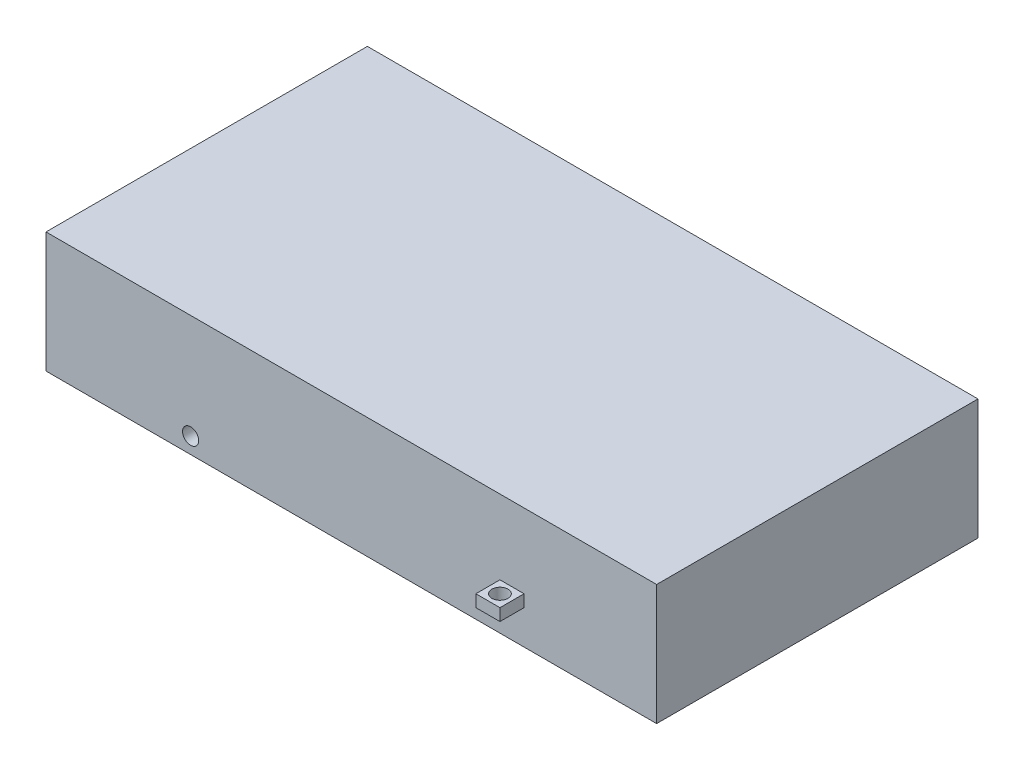
ISO-10303-21;
HEADER;
FILE_DESCRIPTION(('STEP AP214'),'2;1');
FILE_NAME('part.step','',(''),(''),'','','');
FILE_SCHEMA(('AUTOMOTIVE_DESIGN { 1 0 10303 214 1 1 1 1 }'));
ENDSEC;
DATA;
#1=APPLICATION_CONTEXT('core data for automotive mechanical design processes');
#2=APPLICATION_PROTOCOL_DEFINITION('international standard','automotive_design',2000,#1);
#3=PRODUCT_CONTEXT('',#1,'mechanical');
#4=PRODUCT('Part','Part','',(#3));
#5=PRODUCT_RELATED_PRODUCT_CATEGORY('part','',(#4));
#6=PRODUCT_DEFINITION_FORMATION('','',#4);
#7=PRODUCT_DEFINITION_CONTEXT('part definition',#1,'design');
#8=PRODUCT_DEFINITION('design','',#6,#7);
#9=PRODUCT_DEFINITION_SHAPE('','',#8);
#10=(LENGTH_UNIT() NAMED_UNIT(*) SI_UNIT(.MILLI.,.METRE.));
#11=(NAMED_UNIT(*) PLANE_ANGLE_UNIT() SI_UNIT($,.RADIAN.));
#12=(NAMED_UNIT(*) SI_UNIT($,.STERADIAN.) SOLID_ANGLE_UNIT());
#13=UNCERTAINTY_MEASURE_WITH_UNIT(LENGTH_MEASURE(1.E-05),#10,'distance_accuracy_value','');
#14=(GEOMETRIC_REPRESENTATION_CONTEXT(3) GLOBAL_UNCERTAINTY_ASSIGNED_CONTEXT((#13)) GLOBAL_UNIT_ASSIGNED_CONTEXT((#10,
#11,#12)) REPRESENTATION_CONTEXT('',''));
#15=CARTESIAN_POINT('',(0.,0.,0.));
#16=DIRECTION('',(0.,0.,1.));
#17=DIRECTION('',(1.,0.,0.));
#18=AXIS2_PLACEMENT_3D('',#15,#16,#17);
#19=CARTESIAN_POINT('',(-482.6,190.5,-254.));
#20=DIRECTION('',(0.,0.,1.));
#21=DIRECTION('',(1.,0.,0.));
#22=AXIS2_PLACEMENT_3D('',#19,#20,#21);
#23=PLANE('',#22);
#24=DIRECTION('',(-1.,0.,0.));
#25=VECTOR('',#24,1.);
#26=CARTESIAN_POINT('',(-482.6,0.,-254.));
#27=LINE('',#26,#25);
#28=CARTESIAN_POINT('',(482.6,0.,-254.));
#29=VERTEX_POINT('',#28);
#30=CARTESIAN_POINT('',(-482.6,0.,-254.));
#31=VERTEX_POINT('',#30);
#32=EDGE_CURVE('E222',#29,#31,#27,.T.);
#33=ORIENTED_EDGE('',*,*,#32,.T.);
#34=DIRECTION('',(0.,-1.,0.));
#35=VECTOR('',#34,1.);
#36=CARTESIAN_POINT('',(-482.6,190.5,-254.));
#37=LINE('',#36,#35);
#38=CARTESIAN_POINT('',(-482.6,190.5,-254.));
#39=VERTEX_POINT('',#38);
#40=EDGE_CURVE('E45',#39,#31,#37,.T.);
#41=ORIENTED_EDGE('',*,*,#40,.F.);
#42=DIRECTION('',(-1.,0.,0.));
#43=VECTOR('',#42,1.);
#44=CARTESIAN_POINT('',(-482.6,190.5,-254.));
#45=LINE('',#44,#43);
#46=CARTESIAN_POINT('',(482.6,190.5,-254.));
#47=VERTEX_POINT('',#46);
#48=EDGE_CURVE('E212',#47,#39,#45,.T.);
#49=ORIENTED_EDGE('',*,*,#48,.F.);
#50=DIRECTION('',(0.,-1.,0.));
#51=VECTOR('',#50,1.);
#52=CARTESIAN_POINT('',(482.6,190.5,-254.));
#53=LINE('',#52,#51);
#54=EDGE_CURVE('E11',#47,#29,#53,.T.);
#55=ORIENTED_EDGE('',*,*,#54,.T.);
#56=EDGE_LOOP('',(#33,#41,#49,#55));
#57=FACE_BOUND('',#56,.T.);
#58=CARTESIAN_POINT('',(-254.,25.4,-254.));
#59=DIRECTION('',(0.,0.,1.));
#60=DIRECTION('',(1.,0.,0.));
#61=AXIS2_PLACEMENT_3D('',#58,#59,#60);
#62=CIRCLE('',#61,12.7);
#63=CARTESIAN_POINT('',(-241.3,25.4,-254.));
#64=VERTEX_POINT('',#63);
#65=EDGE_CURVE('E172',#64,#64,#62,.F.);
#66=ORIENTED_EDGE('',*,*,#65,.F.);
#67=EDGE_LOOP('',(#66));
#68=FACE_BOUND('',#67,.T.);
#69=DIRECTION('',(0.,1.,0.));
#70=VECTOR('',#69,1.);
#71=CARTESIAN_POINT('',(234.95,53.975,-254.));
#72=LINE('',#71,#70);
#73=CARTESIAN_POINT('',(234.95,53.975,-254.));
#74=VERTEX_POINT('',#73);
#75=CARTESIAN_POINT('',(234.95,73.025,-254.));
#76=VERTEX_POINT('',#75);
#77=EDGE_CURVE('E158',#74,#76,#72,.T.);
#78=ORIENTED_EDGE('',*,*,#77,.F.);
#79=DIRECTION('',(1.,0.,0.));
#80=VECTOR('',#79,1.);
#81=CARTESIAN_POINT('',(234.95,53.975,-254.));
#82=LINE('',#81,#80);
#83=CARTESIAN_POINT('',(273.05,53.975,-254.));
#84=VERTEX_POINT('',#83);
#85=EDGE_CURVE('E134',#74,#84,#82,.T.);
#86=ORIENTED_EDGE('',*,*,#85,.T.);
#87=DIRECTION('',(0.,1.,0.));
#88=VECTOR('',#87,1.);
#89=CARTESIAN_POINT('',(273.05,53.975,-254.));
#90=LINE('',#89,#88);
#91=CARTESIAN_POINT('',(273.05,73.025,-254.));
#92=VERTEX_POINT('',#91);
#93=EDGE_CURVE('E52',#84,#92,#90,.T.);
#94=ORIENTED_EDGE('',*,*,#93,.T.);
#95=DIRECTION('',(1.,0.,0.));
#96=VECTOR('',#95,1.);
#97=CARTESIAN_POINT('',(234.95,73.025,-254.));
#98=LINE('',#97,#96);
#99=EDGE_CURVE('E147',#76,#92,#98,.T.);
#100=ORIENTED_EDGE('',*,*,#99,.F.);
#101=EDGE_LOOP('',(#78,#86,#94,#100));
#102=FACE_BOUND('',#101,.T.);
#103=ADVANCED_FACE('F37',(#57,#68,#102),#23,.F.);
#104=CARTESIAN_POINT('',(482.6,190.5,254.));
#105=DIRECTION('',(-1.,0.,0.));
#106=DIRECTION('',(0.,0.,1.));
#107=AXIS2_PLACEMENT_3D('',#104,#105,#106);
#108=PLANE('',#107);
#109=DIRECTION('',(0.,0.,-1.));
#110=VECTOR('',#109,1.);
#111=CARTESIAN_POINT('',(482.6,0.,254.));
#112=LINE('',#111,#110);
#113=CARTESIAN_POINT('',(482.6,0.,254.));
#114=VERTEX_POINT('',#113);
#115=EDGE_CURVE('E203',#114,#29,#112,.T.);
#116=ORIENTED_EDGE('',*,*,#115,.T.);
#117=ORIENTED_EDGE('',*,*,#54,.F.);
#118=DIRECTION('',(0.,0.,-1.));
#119=VECTOR('',#118,1.);
#120=CARTESIAN_POINT('',(482.6,190.5,254.));
#121=LINE('',#120,#119);
#122=CARTESIAN_POINT('',(482.6,190.5,254.));
#123=VERTEX_POINT('',#122);
#124=EDGE_CURVE('E209',#123,#47,#121,.T.);
#125=ORIENTED_EDGE('',*,*,#124,.F.);
#126=DIRECTION('',(0.,-1.,0.));
#127=VECTOR('',#126,1.);
#128=CARTESIAN_POINT('',(482.6,190.5,254.));
#129=LINE('',#128,#127);
#130=EDGE_CURVE('E219',#123,#114,#129,.T.);
#131=ORIENTED_EDGE('',*,*,#130,.T.);
#132=EDGE_LOOP('',(#116,#117,#125,#131));
#133=FACE_BOUND('',#132,.T.);
#134=ADVANCED_FACE('F39',(#133),#108,.F.);
#135=CARTESIAN_POINT('',(-482.6,190.5,254.));
#136=DIRECTION('',(1.,0.,0.));
#137=DIRECTION('',(0.,0.,-1.));
#138=AXIS2_PLACEMENT_3D('',#135,#136,#137);
#139=PLANE('',#138);
#140=DIRECTION('',(0.,0.,1.));
#141=VECTOR('',#140,1.);
#142=CARTESIAN_POINT('',(-482.6,0.,254.));
#143=LINE('',#142,#141);
#144=CARTESIAN_POINT('',(-482.6,0.,254.));
#145=VERTEX_POINT('',#144);
#146=EDGE_CURVE('E224',#31,#145,#143,.T.);
#147=ORIENTED_EDGE('',*,*,#146,.T.);
#148=DIRECTION('',(0.,-1.,0.));
#149=VECTOR('',#148,1.);
#150=CARTESIAN_POINT('',(-482.6,190.5,254.));
#151=LINE('',#150,#149);
#152=CARTESIAN_POINT('',(-482.6,190.5,254.));
#153=VERTEX_POINT('',#152);
#154=EDGE_CURVE('E229',#153,#145,#151,.T.);
#155=ORIENTED_EDGE('',*,*,#154,.F.);
#156=DIRECTION('',(0.,0.,1.));
#157=VECTOR('',#156,1.);
#158=CARTESIAN_POINT('',(-482.6,190.5,254.));
#159=LINE('',#158,#157);
#160=EDGE_CURVE('E215',#39,#153,#159,.T.);
#161=ORIENTED_EDGE('',*,*,#160,.F.);
#162=ORIENTED_EDGE('',*,*,#40,.T.);
#163=EDGE_LOOP('',(#147,#155,#161,#162));
#164=FACE_BOUND('',#163,.T.);
#165=ADVANCED_FACE('F236',(#164),#139,.F.);
#166=CARTESIAN_POINT('',(-482.6,190.5,254.));
#167=DIRECTION('',(0.,0.,-1.));
#168=DIRECTION('',(-1.,0.,0.));
#169=AXIS2_PLACEMENT_3D('',#166,#167,#168);
#170=PLANE('',#169);
#171=CARTESIAN_POINT('',(-254.,25.4,254.));
#172=DIRECTION('',(0.,0.,1.));
#173=DIRECTION('',(1.,0.,0.));
#174=AXIS2_PLACEMENT_3D('',#171,#172,#173);
#175=CIRCLE('',#174,12.7);
#176=CARTESIAN_POINT('',(-241.3,25.4,254.));
#177=VERTEX_POINT('',#176);
#178=EDGE_CURVE('E166',#177,#177,#175,.T.);
#179=ORIENTED_EDGE('',*,*,#178,.F.);
#180=EDGE_LOOP('',(#179));
#181=FACE_BOUND('',#180,.T.);
#182=DIRECTION('',(1.,0.,0.));
#183=VECTOR('',#182,1.);
#184=CARTESIAN_POINT('',(234.95,53.975,254.));
#185=LINE('',#184,#183);
#186=CARTESIAN_POINT('',(234.95,53.975,254.));
#187=VERTEX_POINT('',#186);
#188=CARTESIAN_POINT('',(273.05,53.975,254.));
#189=VERTEX_POINT('',#188);
#190=EDGE_CURVE('E186',#187,#189,#185,.T.);
#191=ORIENTED_EDGE('',*,*,#190,.F.);
#192=DIRECTION('',(0.,1.,0.));
#193=VECTOR('',#192,1.);
#194=CARTESIAN_POINT('',(234.95,53.975,254.));
#195=LINE('',#194,#193);
#196=CARTESIAN_POINT('',(234.95,73.025,254.));
#197=VERTEX_POINT('',#196);
#198=EDGE_CURVE('E181',#187,#197,#195,.T.);
#199=ORIENTED_EDGE('',*,*,#198,.T.);
#200=DIRECTION('',(1.,0.,0.));
#201=VECTOR('',#200,1.);
#202=CARTESIAN_POINT('',(234.95,73.025,254.));
#203=LINE('',#202,#201);
#204=CARTESIAN_POINT('',(273.05,73.025,254.));
#205=VERTEX_POINT('',#204);
#206=EDGE_CURVE('E196',#197,#205,#203,.T.);
#207=ORIENTED_EDGE('',*,*,#206,.T.);
#208=DIRECTION('',(0.,1.,0.));
#209=VECTOR('',#208,1.);
#210=CARTESIAN_POINT('',(273.05,53.975,254.));
#211=LINE('',#210,#209);
#212=EDGE_CURVE('E60',#189,#205,#211,.T.);
#213=ORIENTED_EDGE('',*,*,#212,.F.);
#214=EDGE_LOOP('',(#191,#199,#207,#213));
#215=FACE_BOUND('',#214,.T.);
#216=DIRECTION('',(1.,0.,0.));
#217=VECTOR('',#216,1.);
#218=CARTESIAN_POINT('',(-482.6,0.,254.));
#219=LINE('',#218,#217);
#220=EDGE_CURVE('E213',#145,#114,#219,.T.);
#221=ORIENTED_EDGE('',*,*,#220,.T.);
#222=ORIENTED_EDGE('',*,*,#130,.F.);
#223=DIRECTION('',(1.,0.,0.));
#224=VECTOR('',#223,1.);
#225=CARTESIAN_POINT('',(-482.6,190.5,254.));
#226=LINE('',#225,#224);
#227=EDGE_CURVE('E217',#153,#123,#226,.T.);
#228=ORIENTED_EDGE('',*,*,#227,.F.);
#229=ORIENTED_EDGE('',*,*,#154,.T.);
#230=EDGE_LOOP('',(#221,#222,#228,#229));
#231=FACE_BOUND('',#230,.T.);
#232=ADVANCED_FACE('F245',(#181,#215,#231),#170,.F.);
#233=CARTESIAN_POINT('',(0.,190.5,0.));
#234=DIRECTION('',(0.,-1.,0.));
#235=DIRECTION('',(0.,0.,-1.));
#236=AXIS2_PLACEMENT_3D('',#233,#234,#235);
#237=PLANE('',#236);
#238=ORIENTED_EDGE('',*,*,#124,.T.);
#239=ORIENTED_EDGE('',*,*,#48,.T.);
#240=ORIENTED_EDGE('',*,*,#160,.T.);
#241=ORIENTED_EDGE('',*,*,#227,.T.);
#242=EDGE_LOOP('',(#238,#239,#240,#241));
#243=FACE_BOUND('',#242,.T.);
#244=ADVANCED_FACE('F251',(#243),#237,.F.);
#245=CARTESIAN_POINT('',(0.,0.,0.));
#246=DIRECTION('',(0.,-1.,0.));
#247=DIRECTION('',(0.,0.,-1.));
#248=AXIS2_PLACEMENT_3D('',#245,#246,#247);
#249=PLANE('',#248);
#250=ORIENTED_EDGE('',*,*,#115,.F.);
#251=ORIENTED_EDGE('',*,*,#220,.F.);
#252=ORIENTED_EDGE('',*,*,#146,.F.);
#253=ORIENTED_EDGE('',*,*,#32,.F.);
#254=EDGE_LOOP('',(#250,#251,#252,#253));
#255=FACE_BOUND('',#254,.T.);
#256=ADVANCED_FACE('F242',(#255),#249,.T.);
#257=CARTESIAN_POINT('',(234.95,53.975,292.1));
#258=DIRECTION('',(-1.,0.,0.));
#259=DIRECTION('',(0.,0.,1.));
#260=AXIS2_PLACEMENT_3D('',#257,#258,#259);
#261=PLANE('',#260);
#262=ORIENTED_EDGE('',*,*,#198,.F.);
#263=DIRECTION('',(0.,0.,-1.));
#264=VECTOR('',#263,1.);
#265=CARTESIAN_POINT('',(234.95,53.975,292.1));
#266=LINE('',#265,#264);
#267=CARTESIAN_POINT('',(234.95,53.975,292.1));
#268=VERTEX_POINT('',#267);
#269=EDGE_CURVE('E201',#268,#187,#266,.T.);
#270=ORIENTED_EDGE('',*,*,#269,.F.);
#271=DIRECTION('',(0.,1.,0.));
#272=VECTOR('',#271,1.);
#273=CARTESIAN_POINT('',(234.95,53.975,292.1));
#274=LINE('',#273,#272);
#275=CARTESIAN_POINT('',(234.95,73.025,292.1));
#276=VERTEX_POINT('',#275);
#277=EDGE_CURVE('E182',#268,#276,#274,.T.);
#278=ORIENTED_EDGE('',*,*,#277,.T.);
#279=DIRECTION('',(0.,0.,-1.));
#280=VECTOR('',#279,1.);
#281=CARTESIAN_POINT('',(234.95,73.025,292.1));
#282=LINE('',#281,#280);
#283=EDGE_CURVE('E193',#276,#197,#282,.T.);
#284=ORIENTED_EDGE('',*,*,#283,.T.);
#285=EDGE_LOOP('',(#262,#270,#278,#284));
#286=FACE_BOUND('',#285,.T.);
#287=ADVANCED_FACE('F292',(#286),#261,.T.);
#288=CARTESIAN_POINT('',(234.95,53.975,292.1));
#289=DIRECTION('',(0.,1.,0.));
#290=DIRECTION('',(0.,0.,1.));
#291=AXIS2_PLACEMENT_3D('',#288,#289,#290);
#292=PLANE('',#291);
#293=CARTESIAN_POINT('',(254.,53.975,273.05));
#294=DIRECTION('',(0.,1.,0.));
#295=DIRECTION('',(0.,0.,1.));
#296=AXIS2_PLACEMENT_3D('',#293,#294,#295);
#297=CIRCLE('',#296,12.7);
#298=CARTESIAN_POINT('',(254.,53.975,285.75));
#299=VERTEX_POINT('',#298);
#300=EDGE_CURVE('E178',#299,#299,#297,.F.);
#301=ORIENTED_EDGE('',*,*,#300,.F.);
#302=EDGE_LOOP('',(#301));
#303=FACE_BOUND('',#302,.T.);
#304=ORIENTED_EDGE('',*,*,#190,.T.);
#305=DIRECTION('',(0.,0.,-1.));
#306=VECTOR('',#305,1.);
#307=CARTESIAN_POINT('',(273.05,53.975,292.1));
#308=LINE('',#307,#306);
#309=CARTESIAN_POINT('',(273.05,53.975,292.1));
#310=VERTEX_POINT('',#309);
#311=EDGE_CURVE('E204',#310,#189,#308,.T.);
#312=ORIENTED_EDGE('',*,*,#311,.F.);
#313=DIRECTION('',(1.,0.,0.));
#314=VECTOR('',#313,1.);
#315=CARTESIAN_POINT('',(234.95,53.975,292.1));
#316=LINE('',#315,#314);
#317=EDGE_CURVE('E191',#268,#310,#316,.T.);
#318=ORIENTED_EDGE('',*,*,#317,.F.);
#319=ORIENTED_EDGE('',*,*,#269,.T.);
#320=EDGE_LOOP('',(#304,#312,#318,#319));
#321=FACE_BOUND('',#320,.T.);
#322=ADVANCED_FACE('F288',(#303,#321),#292,.F.);
#323=CARTESIAN_POINT('',(273.05,53.975,292.1));
#324=DIRECTION('',(-1.,0.,0.));
#325=DIRECTION('',(0.,0.,1.));
#326=AXIS2_PLACEMENT_3D('',#323,#324,#325);
#327=PLANE('',#326);
#328=ORIENTED_EDGE('',*,*,#212,.T.);
#329=DIRECTION('',(0.,0.,-1.));
#330=VECTOR('',#329,1.);
#331=CARTESIAN_POINT('',(273.05,73.025,292.1));
#332=LINE('',#331,#330);
#333=CARTESIAN_POINT('',(273.05,73.025,292.1));
#334=VERTEX_POINT('',#333);
#335=EDGE_CURVE('E206',#334,#205,#332,.T.);
#336=ORIENTED_EDGE('',*,*,#335,.F.);
#337=DIRECTION('',(0.,1.,0.));
#338=VECTOR('',#337,1.);
#339=CARTESIAN_POINT('',(273.05,53.975,292.1));
#340=LINE('',#339,#338);
#341=EDGE_CURVE('E189',#310,#334,#340,.T.);
#342=ORIENTED_EDGE('',*,*,#341,.F.);
#343=ORIENTED_EDGE('',*,*,#311,.T.);
#344=EDGE_LOOP('',(#328,#336,#342,#343));
#345=FACE_BOUND('',#344,.T.);
#346=ADVANCED_FACE('F291',(#345),#327,.F.);
#347=CARTESIAN_POINT('',(234.95,73.025,292.1));
#348=DIRECTION('',(0.,1.,0.));
#349=DIRECTION('',(0.,0.,1.));
#350=AXIS2_PLACEMENT_3D('',#347,#348,#349);
#351=PLANE('',#350);
#352=CARTESIAN_POINT('',(254.,73.025,273.05));
#353=DIRECTION('',(0.,1.,0.));
#354=DIRECTION('',(0.,0.,1.));
#355=AXIS2_PLACEMENT_3D('',#352,#353,#354);
#356=CIRCLE('',#355,12.7);
#357=CARTESIAN_POINT('',(254.,73.025,285.75));
#358=VERTEX_POINT('',#357);
#359=EDGE_CURVE('E175',#358,#358,#356,.T.);
#360=ORIENTED_EDGE('',*,*,#359,.F.);
#361=EDGE_LOOP('',(#360));
#362=FACE_BOUND('',#361,.T.);
#363=ORIENTED_EDGE('',*,*,#206,.F.);
#364=ORIENTED_EDGE('',*,*,#283,.F.);
#365=DIRECTION('',(1.,0.,0.));
#366=VECTOR('',#365,1.);
#367=CARTESIAN_POINT('',(234.95,73.025,292.1));
#368=LINE('',#367,#366);
#369=EDGE_CURVE('E185',#276,#334,#368,.T.);
#370=ORIENTED_EDGE('',*,*,#369,.T.);
#371=ORIENTED_EDGE('',*,*,#335,.T.);
#372=EDGE_LOOP('',(#363,#364,#370,#371));
#373=FACE_BOUND('',#372,.T.);
#374=ADVANCED_FACE('F286',(#362,#373),#351,.T.);
#375=CARTESIAN_POINT('',(0.,0.,292.1));
#376=DIRECTION('',(0.,0.,-1.));
#377=DIRECTION('',(-1.,0.,0.));
#378=AXIS2_PLACEMENT_3D('',#375,#376,#377);
#379=PLANE('',#378);
#380=ORIENTED_EDGE('',*,*,#277,.F.);
#381=ORIENTED_EDGE('',*,*,#317,.T.);
#382=ORIENTED_EDGE('',*,*,#341,.T.);
#383=ORIENTED_EDGE('',*,*,#369,.F.);
#384=EDGE_LOOP('',(#380,#381,#382,#383));
#385=FACE_BOUND('',#384,.T.);
#386=ADVANCED_FACE('F282',(#385),#379,.F.);
#387=CARTESIAN_POINT('',(254.,-0.001000000000001,273.05));
#388=DIRECTION('',(0.,1.,0.));
#389=DIRECTION('',(0.,0.,1.));
#390=AXIS2_PLACEMENT_3D('',#387,#388,#389);
#391=CYLINDRICAL_SURFACE('',#390,12.7);
#392=ORIENTED_EDGE('',*,*,#359,.T.);
#393=EDGE_LOOP('',(#392));
#394=FACE_BOUND('',#393,.T.);
#395=ORIENTED_EDGE('',*,*,#300,.T.);
#396=EDGE_LOOP('',(#395));
#397=FACE_BOUND('',#396,.T.);
#398=ADVANCED_FACE('F278',(#394,#397),#391,.F.);
#399=CARTESIAN_POINT('',(-254.,25.4,-254.001));
#400=DIRECTION('',(0.,0.,1.));
#401=DIRECTION('',(1.,0.,0.));
#402=AXIS2_PLACEMENT_3D('',#399,#400,#401);
#403=CYLINDRICAL_SURFACE('',#402,12.7);
#404=ORIENTED_EDGE('',*,*,#178,.T.);
#405=EDGE_LOOP('',(#404));
#406=FACE_BOUND('',#405,.T.);
#407=ORIENTED_EDGE('',*,*,#65,.T.);
#408=EDGE_LOOP('',(#407));
#409=FACE_BOUND('',#408,.T.);
#410=ADVANCED_FACE('F275',(#406,#409),#403,.F.);
#411=CARTESIAN_POINT('',(234.95,53.975,-292.1));
#412=DIRECTION('',(1.,0.,0.));
#413=DIRECTION('',(0.,0.,-1.));
#414=AXIS2_PLACEMENT_3D('',#411,#412,#413);
#415=PLANE('',#414);
#416=ORIENTED_EDGE('',*,*,#77,.T.);
#417=DIRECTION('',(0.,0.,1.));
#418=VECTOR('',#417,1.);
#419=CARTESIAN_POINT('',(234.95,73.025,-292.1));
#420=LINE('',#419,#418);
#421=CARTESIAN_POINT('',(234.95,73.025,-292.1));
#422=VERTEX_POINT('',#421);
#423=EDGE_CURVE('E145',#422,#76,#420,.T.);
#424=ORIENTED_EDGE('',*,*,#423,.F.);
#425=DIRECTION('',(0.,1.,0.));
#426=VECTOR('',#425,1.);
#427=CARTESIAN_POINT('',(234.95,53.975,-292.1));
#428=LINE('',#427,#426);
#429=CARTESIAN_POINT('',(234.95,53.975,-292.1));
#430=VERTEX_POINT('',#429);
#431=EDGE_CURVE('E143',#430,#422,#428,.T.);
#432=ORIENTED_EDGE('',*,*,#431,.F.);
#433=DIRECTION('',(0.,0.,1.));
#434=VECTOR('',#433,1.);
#435=CARTESIAN_POINT('',(234.95,53.975,-292.1));
#436=LINE('',#435,#434);
#437=EDGE_CURVE('E128',#430,#74,#436,.T.);
#438=ORIENTED_EDGE('',*,*,#437,.T.);
#439=EDGE_LOOP('',(#416,#424,#432,#438));
#440=FACE_BOUND('',#439,.T.);
#441=ADVANCED_FACE('F144',(#440),#415,.F.);
#442=CARTESIAN_POINT('',(234.95,73.025,-292.1));
#443=DIRECTION('',(0.,-1.,0.));
#444=DIRECTION('',(0.,0.,-1.));
#445=AXIS2_PLACEMENT_3D('',#442,#443,#444);
#446=PLANE('',#445);
#447=CARTESIAN_POINT('',(254.,73.025,-273.05));
#448=DIRECTION('',(0.,-1.,0.));
#449=DIRECTION('',(0.,0.,-1.));
#450=AXIS2_PLACEMENT_3D('',#447,#448,#449);
#451=CIRCLE('',#450,12.7);
#452=CARTESIAN_POINT('',(254.,73.025,-285.75));
#453=VERTEX_POINT('',#452);
#454=EDGE_CURVE('E371',#453,#453,#451,.T.);
#455=ORIENTED_EDGE('',*,*,#454,.T.);
#456=EDGE_LOOP('',(#455));
#457=FACE_BOUND('',#456,.T.);
#458=ORIENTED_EDGE('',*,*,#99,.T.);
#459=DIRECTION('',(0.,0.,1.));
#460=VECTOR('',#459,1.);
#461=CARTESIAN_POINT('',(273.05,73.025,-292.1));
#462=LINE('',#461,#460);
#463=CARTESIAN_POINT('',(273.05,73.025,-292.1));
#464=VERTEX_POINT('',#463);
#465=EDGE_CURVE('E167',#464,#92,#462,.T.);
#466=ORIENTED_EDGE('',*,*,#465,.F.);
#467=DIRECTION('',(1.,0.,0.));
#468=VECTOR('',#467,1.);
#469=CARTESIAN_POINT('',(234.95,73.025,-292.1));
#470=LINE('',#469,#468);
#471=EDGE_CURVE('E139',#422,#464,#470,.T.);
#472=ORIENTED_EDGE('',*,*,#471,.F.);
#473=ORIENTED_EDGE('',*,*,#423,.T.);
#474=EDGE_LOOP('',(#458,#466,#472,#473));
#475=FACE_BOUND('',#474,.T.);
#476=ADVANCED_FACE('F259',(#457,#475),#446,.F.);
#477=CARTESIAN_POINT('',(273.05,53.975,-292.1));
#478=DIRECTION('',(1.,0.,0.));
#479=DIRECTION('',(0.,0.,-1.));
#480=AXIS2_PLACEMENT_3D('',#477,#478,#479);
#481=PLANE('',#480);
#482=ORIENTED_EDGE('',*,*,#93,.F.);
#483=DIRECTION('',(0.,0.,1.));
#484=VECTOR('',#483,1.);
#485=CARTESIAN_POINT('',(273.05,53.975,-292.1));
#486=LINE('',#485,#484);
#487=CARTESIAN_POINT('',(273.05,53.975,-292.1));
#488=VERTEX_POINT('',#487);
#489=EDGE_CURVE('E138',#488,#84,#486,.T.);
#490=ORIENTED_EDGE('',*,*,#489,.F.);
#491=DIRECTION('',(0.,1.,0.));
#492=VECTOR('',#491,1.);
#493=CARTESIAN_POINT('',(273.05,53.975,-292.1));
#494=LINE('',#493,#492);
#495=EDGE_CURVE('E152',#488,#464,#494,.T.);
#496=ORIENTED_EDGE('',*,*,#495,.T.);
#497=ORIENTED_EDGE('',*,*,#465,.T.);
#498=EDGE_LOOP('',(#482,#490,#496,#497));
#499=FACE_BOUND('',#498,.T.);
#500=ADVANCED_FACE('F260',(#499),#481,.T.);
#501=CARTESIAN_POINT('',(234.95,53.975,-292.1));
#502=DIRECTION('',(0.,-1.,0.));
#503=DIRECTION('',(0.,0.,-1.));
#504=AXIS2_PLACEMENT_3D('',#501,#502,#503);
#505=PLANE('',#504);
#506=CARTESIAN_POINT('',(254.,53.975,-273.05));
#507=DIRECTION('',(0.,-1.,0.));
#508=DIRECTION('',(0.,0.,-1.));
#509=AXIS2_PLACEMENT_3D('',#506,#507,#508);
#510=CIRCLE('',#509,12.7);
#511=CARTESIAN_POINT('',(254.,53.975,-285.75));
#512=VERTEX_POINT('',#511);
#513=EDGE_CURVE('E160',#512,#512,#510,.T.);
#514=ORIENTED_EDGE('',*,*,#513,.F.);
#515=EDGE_LOOP('',(#514));
#516=FACE_BOUND('',#515,.T.);
#517=ORIENTED_EDGE('',*,*,#85,.F.);
#518=ORIENTED_EDGE('',*,*,#437,.F.);
#519=DIRECTION('',(1.,0.,0.));
#520=VECTOR('',#519,1.);
#521=CARTESIAN_POINT('',(234.95,53.975,-292.1));
#522=LINE('',#521,#520);
#523=EDGE_CURVE('E132',#430,#488,#522,.T.);
#524=ORIENTED_EDGE('',*,*,#523,.T.);
#525=ORIENTED_EDGE('',*,*,#489,.T.);
#526=EDGE_LOOP('',(#517,#518,#524,#525));
#527=FACE_BOUND('',#526,.T.);
#528=ADVANCED_FACE('F130',(#516,#527),#505,.T.);
#529=CARTESIAN_POINT('',(0.,0.,-292.1));
#530=DIRECTION('',(0.,0.,1.));
#531=DIRECTION('',(-1.,0.,0.));
#532=AXIS2_PLACEMENT_3D('',#529,#530,#531);
#533=PLANE('',#532);
#534=ORIENTED_EDGE('',*,*,#431,.T.);
#535=ORIENTED_EDGE('',*,*,#471,.T.);
#536=ORIENTED_EDGE('',*,*,#495,.F.);
#537=ORIENTED_EDGE('',*,*,#523,.F.);
#538=EDGE_LOOP('',(#534,#535,#536,#537));
#539=FACE_BOUND('',#538,.T.);
#540=ADVANCED_FACE('F150',(#539),#533,.F.);
#541=CARTESIAN_POINT('',(254.,-0.001000000000001,-273.05));
#542=DIRECTION('',(0.,1.,0.));
#543=DIRECTION('',(0.,0.,1.));
#544=AXIS2_PLACEMENT_3D('',#541,#542,#543);
#545=CYLINDRICAL_SURFACE('',#544,12.7);
#546=ORIENTED_EDGE('',*,*,#513,.T.);
#547=EDGE_LOOP('',(#546));
#548=FACE_BOUND('',#547,.T.);
#549=ORIENTED_EDGE('',*,*,#454,.F.);
#550=EDGE_LOOP('',(#549));
#551=FACE_BOUND('',#550,.T.);
#552=ADVANCED_FACE('F354',(#548,#551),#545,.F.);
#553=CLOSED_SHELL('',(#103,#134,#165,#232,#244,#256,#287,#322,#346,#374,#386,#398,#410,#441,
#476,#500,#528,#540,#552));
#554=MANIFOLD_SOLID_BREP('B2',#553);
#555=ADVANCED_BREP_SHAPE_REPRESENTATION('',(#18,#554),#14);
#556=SHAPE_DEFINITION_REPRESENTATION(#9,#555);
ENDSEC;
END-ISO-10303-21;
